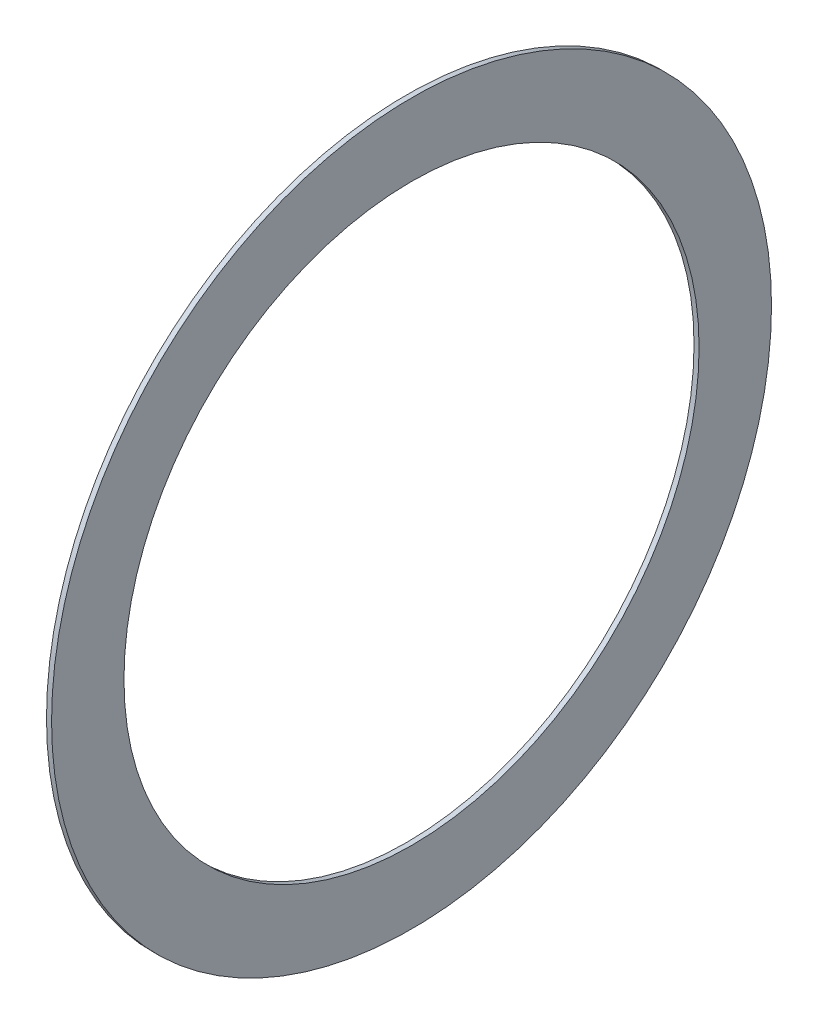
ISO-10303-21;
HEADER;
FILE_DESCRIPTION(('STEP AP214'),'2;1');
FILE_NAME('part.step','',(''),(''),'','','');
FILE_SCHEMA(('AUTOMOTIVE_DESIGN { 1 0 10303 214 1 1 1 1 }'));
ENDSEC;
DATA;
#1=APPLICATION_CONTEXT('core data for automotive mechanical design processes');
#2=APPLICATION_PROTOCOL_DEFINITION('international standard','automotive_design',2000,#1);
#3=PRODUCT_CONTEXT('',#1,'mechanical');
#4=PRODUCT('Part','Part','',(#3));
#5=PRODUCT_RELATED_PRODUCT_CATEGORY('part','',(#4));
#6=PRODUCT_DEFINITION_FORMATION('','',#4);
#7=PRODUCT_DEFINITION_CONTEXT('part definition',#1,'design');
#8=PRODUCT_DEFINITION('design','',#6,#7);
#9=PRODUCT_DEFINITION_SHAPE('','',#8);
#10=(LENGTH_UNIT() NAMED_UNIT(*) SI_UNIT(.MILLI.,.METRE.));
#11=(NAMED_UNIT(*) PLANE_ANGLE_UNIT() SI_UNIT($,.RADIAN.));
#12=(NAMED_UNIT(*) SI_UNIT($,.STERADIAN.) SOLID_ANGLE_UNIT());
#13=UNCERTAINTY_MEASURE_WITH_UNIT(LENGTH_MEASURE(1.E-05),#10,'distance_accuracy_value','');
#14=(GEOMETRIC_REPRESENTATION_CONTEXT(3) GLOBAL_UNCERTAINTY_ASSIGNED_CONTEXT((#13)) GLOBAL_UNIT_ASSIGNED_CONTEXT((#10,
#11,#12)) REPRESENTATION_CONTEXT('',''));
#15=CARTESIAN_POINT('',(0.,0.,0.));
#16=DIRECTION('',(0.,0.,1.));
#17=DIRECTION('',(1.,0.,0.));
#18=AXIS2_PLACEMENT_3D('',#15,#16,#17);
#19=CARTESIAN_POINT('',(0.2415,0.,0.));
#20=DIRECTION('',(1.,0.,0.));
#21=DIRECTION('',(0.,0.,-1.));
#22=AXIS2_PLACEMENT_3D('',#19,#20,#21);
#23=CYLINDRICAL_SURFACE('',#22,17.15);
#24=CARTESIAN_POINT('',(0.2415,0.,0.));
#25=DIRECTION('',(1.,0.,0.));
#26=DIRECTION('',(0.,0.,-1.));
#27=AXIS2_PLACEMENT_3D('',#24,#25,#26);
#28=CIRCLE('',#27,17.15);
#29=CARTESIAN_POINT('',(0.2415,0.,-17.15));
#30=VERTEX_POINT('',#29);
#31=EDGE_CURVE('E11',#30,#30,#28,.T.);
#32=ORIENTED_EDGE('',*,*,#31,.F.);
#33=EDGE_LOOP('',(#32));
#34=FACE_BOUND('',#33,.T.);
#35=CARTESIAN_POINT('',(0.,0.,0.));
#36=DIRECTION('',(1.,0.,0.));
#37=DIRECTION('',(0.,0.,-1.));
#38=AXIS2_PLACEMENT_3D('',#35,#36,#37);
#39=CIRCLE('',#38,17.15);
#40=CARTESIAN_POINT('',(0.,0.,-17.15));
#41=VERTEX_POINT('',#40);
#42=EDGE_CURVE('E50',#41,#41,#39,.T.);
#43=ORIENTED_EDGE('',*,*,#42,.T.);
#44=EDGE_LOOP('',(#43));
#45=FACE_BOUND('',#44,.T.);
#46=ADVANCED_FACE('F16',(#34,#45),#23,.T.);
#47=CARTESIAN_POINT('',(0.2415,13.7,0.));
#48=DIRECTION('',(1.,0.,0.));
#49=DIRECTION('',(0.,1.,0.));
#50=AXIS2_PLACEMENT_3D('',#47,#48,#49);
#51=PLANE('',#50);
#52=CARTESIAN_POINT('',(0.2415,0.,0.));
#53=DIRECTION('',(1.,0.,0.));
#54=DIRECTION('',(0.,0.,-1.));
#55=AXIS2_PLACEMENT_3D('',#52,#53,#54);
#56=CIRCLE('',#55,13.7);
#57=CARTESIAN_POINT('',(0.2415,0.,-13.7));
#58=VERTEX_POINT('',#57);
#59=EDGE_CURVE('E26',#58,#58,#56,.T.);
#60=ORIENTED_EDGE('',*,*,#59,.F.);
#61=EDGE_LOOP('',(#60));
#62=FACE_BOUND('',#61,.T.);
#63=ORIENTED_EDGE('',*,*,#31,.T.);
#64=EDGE_LOOP('',(#63));
#65=FACE_BOUND('',#64,.T.);
#66=ADVANCED_FACE('F73',(#62,#65),#51,.T.);
#67=CARTESIAN_POINT('',(0.2415,0.,0.));
#68=DIRECTION('',(1.,0.,0.));
#69=DIRECTION('',(0.,0.,-1.));
#70=AXIS2_PLACEMENT_3D('',#67,#68,#69);
#71=CYLINDRICAL_SURFACE('',#70,13.7);
#72=CARTESIAN_POINT('',(0.,0.,0.));
#73=DIRECTION('',(1.,0.,0.));
#74=DIRECTION('',(0.,0.,-1.));
#75=AXIS2_PLACEMENT_3D('',#72,#73,#74);
#76=CIRCLE('',#75,13.7);
#77=CARTESIAN_POINT('',(0.,0.,-13.7));
#78=VERTEX_POINT('',#77);
#79=EDGE_CURVE('E44',#78,#78,#76,.T.);
#80=ORIENTED_EDGE('',*,*,#79,.F.);
#81=EDGE_LOOP('',(#80));
#82=FACE_BOUND('',#81,.T.);
#83=ORIENTED_EDGE('',*,*,#59,.T.);
#84=EDGE_LOOP('',(#83));
#85=FACE_BOUND('',#84,.T.);
#86=ADVANCED_FACE('F18',(#82,#85),#71,.F.);
#87=CARTESIAN_POINT('',(0.,17.15,0.));
#88=DIRECTION('',(-1.,0.,0.));
#89=DIRECTION('',(0.,0.,1.));
#90=AXIS2_PLACEMENT_3D('',#87,#88,#89);
#91=PLANE('',#90);
#92=ORIENTED_EDGE('',*,*,#42,.F.);
#93=EDGE_LOOP('',(#92));
#94=FACE_BOUND('',#93,.T.);
#95=ORIENTED_EDGE('',*,*,#79,.T.);
#96=EDGE_LOOP('',(#95));
#97=FACE_BOUND('',#96,.T.);
#98=ADVANCED_FACE('F84',(#94,#97),#91,.T.);
#99=CLOSED_SHELL('',(#46,#66,#86,#98));
#100=MANIFOLD_SOLID_BREP('B1',#99);
#101=ADVANCED_BREP_SHAPE_REPRESENTATION('',(#18,#100),#14);
#102=SHAPE_DEFINITION_REPRESENTATION(#9,#101);
ENDSEC;
END-ISO-10303-21;
